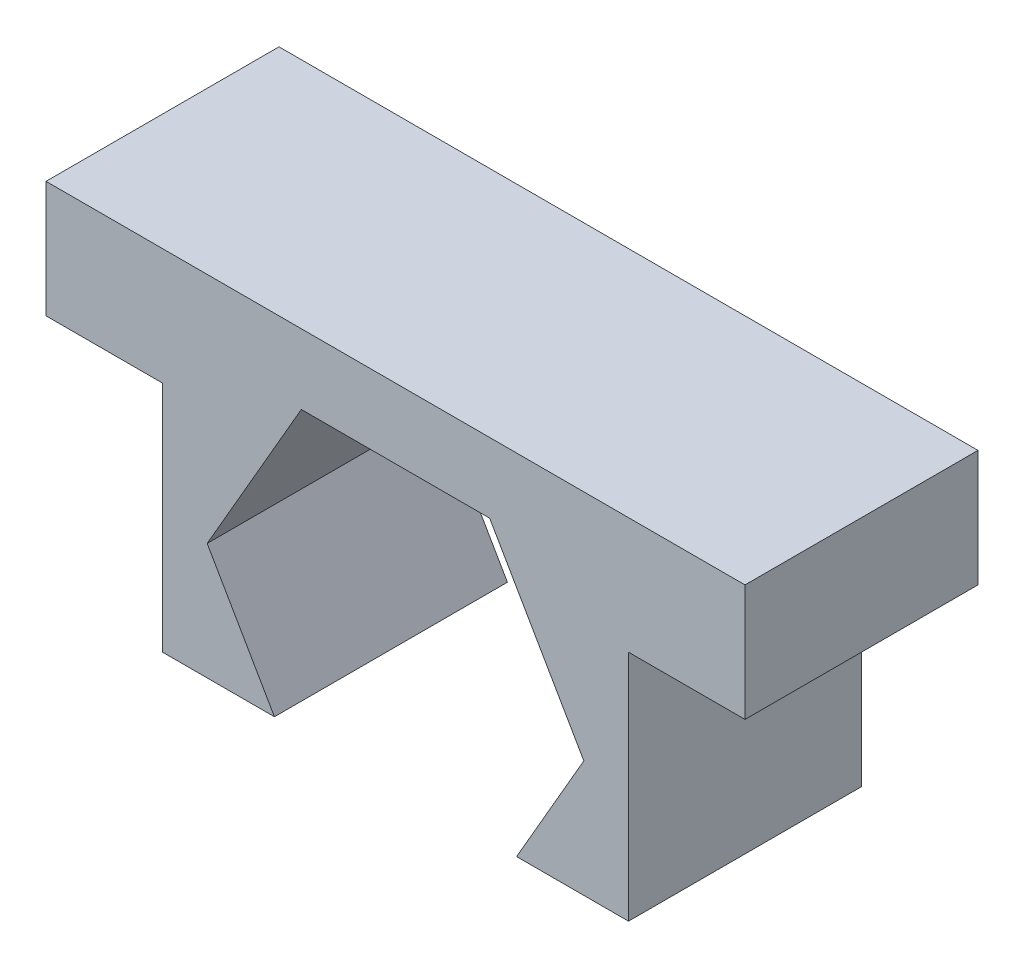
ISO-10303-21;
HEADER;
FILE_DESCRIPTION(('STEP AP214'),'2;1');
FILE_NAME('part.step','',(''),(''),'','','');
FILE_SCHEMA(('AUTOMOTIVE_DESIGN { 1 0 10303 214 1 1 1 1 }'));
ENDSEC;
DATA;
#1=APPLICATION_CONTEXT('core data for automotive mechanical design processes');
#2=APPLICATION_PROTOCOL_DEFINITION('international standard','automotive_design',2000,#1);
#3=PRODUCT_CONTEXT('',#1,'mechanical');
#4=PRODUCT('Part','Part','',(#3));
#5=PRODUCT_RELATED_PRODUCT_CATEGORY('part','',(#4));
#6=PRODUCT_DEFINITION_FORMATION('','',#4);
#7=PRODUCT_DEFINITION_CONTEXT('part definition',#1,'design');
#8=PRODUCT_DEFINITION('design','',#6,#7);
#9=PRODUCT_DEFINITION_SHAPE('','',#8);
#10=(LENGTH_UNIT() NAMED_UNIT(*) SI_UNIT(.MILLI.,.METRE.));
#11=(NAMED_UNIT(*) PLANE_ANGLE_UNIT() SI_UNIT($,.RADIAN.));
#12=(NAMED_UNIT(*) SI_UNIT($,.STERADIAN.) SOLID_ANGLE_UNIT());
#13=UNCERTAINTY_MEASURE_WITH_UNIT(LENGTH_MEASURE(1.E-05),#10,'distance_accuracy_value','');
#14=(GEOMETRIC_REPRESENTATION_CONTEXT(3) GLOBAL_UNCERTAINTY_ASSIGNED_CONTEXT((#13)) GLOBAL_UNIT_ASSIGNED_CONTEXT((#10,
#11,#12)) REPRESENTATION_CONTEXT('',''));
#15=CARTESIAN_POINT('',(0.,0.,0.));
#16=DIRECTION('',(0.,0.,1.));
#17=DIRECTION('',(1.,0.,0.));
#18=AXIS2_PLACEMENT_3D('',#15,#16,#17);
#19=CARTESIAN_POINT('',(0.,0.,5.));
#20=DIRECTION('',(-1.,0.,0.));
#21=DIRECTION('',(0.,0.,1.));
#22=AXIS2_PLACEMENT_3D('',#19,#20,#21);
#23=PLANE('',#22);
#24=DIRECTION('',(0.,1.,0.));
#25=VECTOR('',#24,1.);
#26=CARTESIAN_POINT('',(0.,0.,0.));
#27=LINE('',#26,#25);
#28=CARTESIAN_POINT('',(0.,2.5,0.));
#29=VERTEX_POINT('',#28);
#30=CARTESIAN_POINT('',(0.,7.5,0.));
#31=VERTEX_POINT('',#30);
#32=EDGE_CURVE('E169',#29,#31,#27,.T.);
#33=ORIENTED_EDGE('',*,*,#32,.F.);
#34=DIRECTION('',(0.,0.,-1.));
#35=VECTOR('',#34,1.);
#36=CARTESIAN_POINT('',(0.,2.5,5.));
#37=LINE('',#36,#35);
#38=CARTESIAN_POINT('',(0.,2.5,5.));
#39=VERTEX_POINT('',#38);
#40=EDGE_CURVE('E11',#39,#29,#37,.T.);
#41=ORIENTED_EDGE('',*,*,#40,.F.);
#42=DIRECTION('',(0.,1.,0.));
#43=VECTOR('',#42,1.);
#44=CARTESIAN_POINT('',(0.,0.,5.));
#45=LINE('',#44,#43);
#46=CARTESIAN_POINT('',(0.,7.5,5.));
#47=VERTEX_POINT('',#46);
#48=EDGE_CURVE('E204',#39,#47,#45,.T.);
#49=ORIENTED_EDGE('',*,*,#48,.T.);
#50=DIRECTION('',(0.,0.,-1.));
#51=VECTOR('',#50,1.);
#52=CARTESIAN_POINT('',(0.,7.5,5.));
#53=LINE('',#52,#51);
#54=EDGE_CURVE('E54',#47,#31,#53,.T.);
#55=ORIENTED_EDGE('',*,*,#54,.T.);
#56=EDGE_LOOP('',(#33,#41,#49,#55));
#57=FACE_BOUND('',#56,.T.);
#58=ADVANCED_FACE('F38',(#57),#23,.T.);
#59=CARTESIAN_POINT('',(0.,2.5,5.));
#60=DIRECTION('',(0.,1.,0.));
#61=DIRECTION('',(0.,0.,1.));
#62=AXIS2_PLACEMENT_3D('',#59,#60,#61);
#63=PLANE('',#62);
#64=DIRECTION('',(1.,0.,0.));
#65=VECTOR('',#64,1.);
#66=CARTESIAN_POINT('',(0.,2.5,0.));
#67=LINE('',#66,#65);
#68=CARTESIAN_POINT('',(2.40192378864668,2.5,0.));
#69=VERTEX_POINT('',#68);
#70=EDGE_CURVE('E171',#29,#69,#67,.T.);
#71=ORIENTED_EDGE('',*,*,#70,.T.);
#72=DIRECTION('',(0.,0.,-1.));
#73=VECTOR('',#72,1.);
#74=CARTESIAN_POINT('',(2.40192378864668,2.5,5.));
#75=LINE('',#74,#73);
#76=CARTESIAN_POINT('',(2.40192378864668,2.5,5.));
#77=VERTEX_POINT('',#76);
#78=EDGE_CURVE('E46',#77,#69,#75,.T.);
#79=ORIENTED_EDGE('',*,*,#78,.F.);
#80=DIRECTION('',(1.,0.,0.));
#81=VECTOR('',#80,1.);
#82=CARTESIAN_POINT('',(0.,2.5,5.));
#83=LINE('',#82,#81);
#84=EDGE_CURVE('E246',#39,#77,#83,.T.);
#85=ORIENTED_EDGE('',*,*,#84,.F.);
#86=ORIENTED_EDGE('',*,*,#40,.T.);
#87=EDGE_LOOP('',(#71,#79,#85,#86));
#88=FACE_BOUND('',#87,.T.);
#89=ADVANCED_FACE('F234',(#88),#63,.F.);
#90=CARTESIAN_POINT('',(2.88397459621556,1.6650635094611,5.));
#91=DIRECTION('',(0.866025403784439,0.5,0.));
#92=DIRECTION('',(-0.5,0.866025403784439,0.));
#93=AXIS2_PLACEMENT_3D('',#90,#91,#92);
#94=PLANE('',#93);
#95=DIRECTION('',(0.5,-0.866025403784439,0.));
#96=VECTOR('',#95,1.);
#97=CARTESIAN_POINT('',(2.88397459621556,1.6650635094611,0.));
#98=LINE('',#97,#96);
#99=CARTESIAN_POINT('',(0.95854811567262,5.,0.));
#100=VERTEX_POINT('',#99);
#101=EDGE_CURVE('E174',#100,#69,#98,.T.);
#102=ORIENTED_EDGE('',*,*,#101,.F.);
#103=DIRECTION('',(0.,0.,-1.));
#104=VECTOR('',#103,1.);
#105=CARTESIAN_POINT('',(0.95854811567262,5.,5.));
#106=LINE('',#105,#104);
#107=CARTESIAN_POINT('',(0.95854811567262,5.,5.));
#108=VERTEX_POINT('',#107);
#109=EDGE_CURVE('E224',#108,#100,#106,.T.);
#110=ORIENTED_EDGE('',*,*,#109,.F.);
#111=DIRECTION('',(0.5,-0.866025403784439,0.));
#112=VECTOR('',#111,1.);
#113=CARTESIAN_POINT('',(2.88397459621556,1.6650635094611,5.));
#114=LINE('',#113,#112);
#115=EDGE_CURVE('E231',#108,#77,#114,.T.);
#116=ORIENTED_EDGE('',*,*,#115,.T.);
#117=ORIENTED_EDGE('',*,*,#78,.T.);
#118=EDGE_LOOP('',(#102,#110,#116,#117));
#119=FACE_BOUND('',#118,.T.);
#120=ADVANCED_FACE('F229',(#119),#94,.T.);
#121=CARTESIAN_POINT('',(-1.44615242270663,0.834936490538904,5.));
#122=DIRECTION('',(0.866025403784439,-0.5,0.));
#123=DIRECTION('',(0.5,0.866025403784439,0.));
#124=AXIS2_PLACEMENT_3D('',#121,#122,#123);
#125=PLANE('',#124);
#126=DIRECTION('',(-0.5,-0.866025403784439,0.));
#127=VECTOR('',#126,1.);
#128=CARTESIAN_POINT('',(-1.44615242270663,0.834936490538904,0.));
#129=LINE('',#128,#127);
#130=CARTESIAN_POINT('',(2.97927405783631,8.5,0.));
#131=VERTEX_POINT('',#130);
#132=EDGE_CURVE('E178',#131,#100,#129,.T.);
#133=ORIENTED_EDGE('',*,*,#132,.F.);
#134=DIRECTION('',(0.,0.,-1.));
#135=VECTOR('',#134,1.);
#136=CARTESIAN_POINT('',(2.97927405783631,8.5,5.));
#137=LINE('',#136,#135);
#138=CARTESIAN_POINT('',(2.97927405783631,8.5,5.));
#139=VERTEX_POINT('',#138);
#140=EDGE_CURVE('E222',#139,#131,#137,.T.);
#141=ORIENTED_EDGE('',*,*,#140,.F.);
#142=DIRECTION('',(-0.5,-0.866025403784439,0.));
#143=VECTOR('',#142,1.);
#144=CARTESIAN_POINT('',(-1.44615242270663,0.834936490538904,5.));
#145=LINE('',#144,#143);
#146=EDGE_CURVE('E243',#139,#108,#145,.T.);
#147=ORIENTED_EDGE('',*,*,#146,.T.);
#148=ORIENTED_EDGE('',*,*,#109,.T.);
#149=EDGE_LOOP('',(#133,#141,#147,#148));
#150=FACE_BOUND('',#149,.T.);
#151=ADVANCED_FACE('F240',(#150),#125,.T.);
#152=CARTESIAN_POINT('',(0.,8.5,5.));
#153=DIRECTION('',(0.,-1.,0.));
#154=DIRECTION('',(0.,0.,-1.));
#155=AXIS2_PLACEMENT_3D('',#152,#153,#154);
#156=PLANE('',#155);
#157=DIRECTION('',(-1.,0.,0.));
#158=VECTOR('',#157,1.);
#159=CARTESIAN_POINT('',(0.,8.5,0.));
#160=LINE('',#159,#158);
#161=CARTESIAN_POINT('',(7.02072594216369,8.5,0.));
#162=VERTEX_POINT('',#161);
#163=EDGE_CURVE('E181',#162,#131,#160,.T.);
#164=ORIENTED_EDGE('',*,*,#163,.F.);
#165=DIRECTION('',(0.,0.,-1.));
#166=VECTOR('',#165,1.);
#167=CARTESIAN_POINT('',(7.02072594216369,8.5,5.));
#168=LINE('',#167,#166);
#169=CARTESIAN_POINT('',(7.02072594216369,8.5,5.));
#170=VERTEX_POINT('',#169);
#171=EDGE_CURVE('E220',#170,#162,#168,.T.);
#172=ORIENTED_EDGE('',*,*,#171,.F.);
#173=DIRECTION('',(-1.,0.,0.));
#174=VECTOR('',#173,1.);
#175=CARTESIAN_POINT('',(0.,8.5,5.));
#176=LINE('',#175,#174);
#177=EDGE_CURVE('E248',#170,#139,#176,.T.);
#178=ORIENTED_EDGE('',*,*,#177,.T.);
#179=ORIENTED_EDGE('',*,*,#140,.T.);
#180=EDGE_LOOP('',(#164,#172,#178,#179));
#181=FACE_BOUND('',#180,.T.);
#182=ADVANCED_FACE('F314',(#181),#156,.T.);
#183=CARTESIAN_POINT('',(8.94615242270663,5.16506350946109,5.));
#184=DIRECTION('',(-0.866025403784439,-0.5,0.));
#185=DIRECTION('',(0.5,-0.866025403784439,0.));
#186=AXIS2_PLACEMENT_3D('',#183,#184,#185);
#187=PLANE('',#186);
#188=DIRECTION('',(-0.5,0.866025403784439,0.));
#189=VECTOR('',#188,1.);
#190=CARTESIAN_POINT('',(8.94615242270663,5.16506350946109,0.));
#191=LINE('',#190,#189);
#192=CARTESIAN_POINT('',(9.04145188432738,4.99999999999999,0.));
#193=VERTEX_POINT('',#192);
#194=EDGE_CURVE('E184',#193,#162,#191,.T.);
#195=ORIENTED_EDGE('',*,*,#194,.F.);
#196=DIRECTION('',(0.,0.,-1.));
#197=VECTOR('',#196,1.);
#198=CARTESIAN_POINT('',(9.04145188432738,4.99999999999999,5.));
#199=LINE('',#198,#197);
#200=CARTESIAN_POINT('',(9.04145188432738,4.99999999999999,5.));
#201=VERTEX_POINT('',#200);
#202=EDGE_CURVE('E218',#201,#193,#199,.T.);
#203=ORIENTED_EDGE('',*,*,#202,.F.);
#204=DIRECTION('',(-0.5,0.866025403784439,0.));
#205=VECTOR('',#204,1.);
#206=CARTESIAN_POINT('',(8.94615242270663,5.16506350946109,5.));
#207=LINE('',#206,#205);
#208=EDGE_CURVE('E255',#201,#170,#207,.T.);
#209=ORIENTED_EDGE('',*,*,#208,.T.);
#210=ORIENTED_EDGE('',*,*,#171,.T.);
#211=EDGE_LOOP('',(#195,#203,#209,#210));
#212=FACE_BOUND('',#211,.T.);
#213=ADVANCED_FACE('F302',(#212),#187,.T.);
#214=CARTESIAN_POINT('',(4.61602540378444,-2.6650635094611,5.));
#215=DIRECTION('',(-0.866025403784439,0.5,0.));
#216=DIRECTION('',(-0.5,-0.866025403784439,0.));
#217=AXIS2_PLACEMENT_3D('',#214,#215,#216);
#218=PLANE('',#217);
#219=DIRECTION('',(0.5,0.866025403784439,0.));
#220=VECTOR('',#219,1.);
#221=CARTESIAN_POINT('',(4.61602540378444,-2.6650635094611,0.));
#222=LINE('',#221,#220);
#223=CARTESIAN_POINT('',(7.59807621135332,2.5,0.));
#224=VERTEX_POINT('',#223);
#225=EDGE_CURVE('E187',#224,#193,#222,.T.);
#226=ORIENTED_EDGE('',*,*,#225,.F.);
#227=DIRECTION('',(0.,0.,-1.));
#228=VECTOR('',#227,1.);
#229=CARTESIAN_POINT('',(7.59807621135332,2.5,5.));
#230=LINE('',#229,#228);
#231=CARTESIAN_POINT('',(7.59807621135332,2.5,5.));
#232=VERTEX_POINT('',#231);
#233=EDGE_CURVE('E216',#232,#224,#230,.T.);
#234=ORIENTED_EDGE('',*,*,#233,.F.);
#235=DIRECTION('',(0.5,0.866025403784439,0.));
#236=VECTOR('',#235,1.);
#237=CARTESIAN_POINT('',(4.61602540378444,-2.6650635094611,5.));
#238=LINE('',#237,#236);
#239=EDGE_CURVE('E258',#232,#201,#238,.T.);
#240=ORIENTED_EDGE('',*,*,#239,.T.);
#241=ORIENTED_EDGE('',*,*,#202,.T.);
#242=EDGE_LOOP('',(#226,#234,#240,#241));
#243=FACE_BOUND('',#242,.T.);
#244=ADVANCED_FACE('F295',(#243),#218,.T.);
#245=CARTESIAN_POINT('',(10.,2.5,0.));
#246=VERTEX_POINT('',#245);
#247=EDGE_CURVE('E175',#224,#246,#67,.T.);
#248=ORIENTED_EDGE('',*,*,#247,.T.);
#249=DIRECTION('',(0.,0.,-1.));
#250=VECTOR('',#249,1.);
#251=CARTESIAN_POINT('',(10.,2.5,5.));
#252=LINE('',#251,#250);
#253=CARTESIAN_POINT('',(10.,2.5,5.));
#254=VERTEX_POINT('',#253);
#255=EDGE_CURVE('E213',#254,#246,#252,.T.);
#256=ORIENTED_EDGE('',*,*,#255,.F.);
#257=EDGE_CURVE('E251',#232,#254,#83,.T.);
#258=ORIENTED_EDGE('',*,*,#257,.F.);
#259=ORIENTED_EDGE('',*,*,#233,.T.);
#260=EDGE_LOOP('',(#248,#256,#258,#259));
#261=FACE_BOUND('',#260,.T.);
#262=ADVANCED_FACE('F287',(#261),#63,.F.);
#263=CARTESIAN_POINT('',(10.,0.,5.));
#264=DIRECTION('',(-1.,0.,0.));
#265=DIRECTION('',(0.,0.,1.));
#266=AXIS2_PLACEMENT_3D('',#263,#264,#265);
#267=PLANE('',#266);
#268=DIRECTION('',(0.,1.,0.));
#269=VECTOR('',#268,1.);
#270=CARTESIAN_POINT('',(10.,0.,0.));
#271=LINE('',#270,#269);
#272=CARTESIAN_POINT('',(10.,7.5,0.));
#273=VERTEX_POINT('',#272);
#274=EDGE_CURVE('E190',#246,#273,#271,.T.);
#275=ORIENTED_EDGE('',*,*,#274,.T.);
#276=DIRECTION('',(0.,0.,-1.));
#277=VECTOR('',#276,1.);
#278=CARTESIAN_POINT('',(10.,7.5,5.));
#279=LINE('',#278,#277);
#280=CARTESIAN_POINT('',(10.,7.5,5.));
#281=VERTEX_POINT('',#280);
#282=EDGE_CURVE('E210',#281,#273,#279,.T.);
#283=ORIENTED_EDGE('',*,*,#282,.F.);
#284=DIRECTION('',(0.,1.,0.));
#285=VECTOR('',#284,1.);
#286=CARTESIAN_POINT('',(10.,0.,5.));
#287=LINE('',#286,#285);
#288=EDGE_CURVE('E261',#254,#281,#287,.T.);
#289=ORIENTED_EDGE('',*,*,#288,.F.);
#290=ORIENTED_EDGE('',*,*,#255,.T.);
#291=EDGE_LOOP('',(#275,#283,#289,#290));
#292=FACE_BOUND('',#291,.T.);
#293=ADVANCED_FACE('F294',(#292),#267,.F.);
#294=CARTESIAN_POINT('',(0.,7.5,5.));
#295=DIRECTION('',(0.,1.,0.));
#296=DIRECTION('',(0.,0.,1.));
#297=AXIS2_PLACEMENT_3D('',#294,#295,#296);
#298=PLANE('',#297);
#299=DIRECTION('',(1.,0.,0.));
#300=VECTOR('',#299,1.);
#301=CARTESIAN_POINT('',(0.,7.5,0.));
#302=LINE('',#301,#300);
#303=CARTESIAN_POINT('',(12.5,7.5,0.));
#304=VERTEX_POINT('',#303);
#305=EDGE_CURVE('E192',#273,#304,#302,.T.);
#306=ORIENTED_EDGE('',*,*,#305,.T.);
#307=DIRECTION('',(0.,0.,-1.));
#308=VECTOR('',#307,1.);
#309=CARTESIAN_POINT('',(12.5,7.5,5.));
#310=LINE('',#309,#308);
#311=CARTESIAN_POINT('',(12.5,7.5,5.));
#312=VERTEX_POINT('',#311);
#313=EDGE_CURVE('E208',#312,#304,#310,.T.);
#314=ORIENTED_EDGE('',*,*,#313,.F.);
#315=DIRECTION('',(1.,0.,0.));
#316=VECTOR('',#315,1.);
#317=CARTESIAN_POINT('',(0.,7.5,5.));
#318=LINE('',#317,#316);
#319=EDGE_CURVE('E164',#281,#312,#318,.T.);
#320=ORIENTED_EDGE('',*,*,#319,.F.);
#321=ORIENTED_EDGE('',*,*,#282,.T.);
#322=EDGE_LOOP('',(#306,#314,#320,#321));
#323=FACE_BOUND('',#322,.T.);
#324=ADVANCED_FACE('F267',(#323),#298,.F.);
#325=CARTESIAN_POINT('',(12.5,0.,5.));
#326=DIRECTION('',(1.,0.,0.));
#327=DIRECTION('',(0.,0.,-1.));
#328=AXIS2_PLACEMENT_3D('',#325,#326,#327);
#329=PLANE('',#328);
#330=DIRECTION('',(0.,-1.,0.));
#331=VECTOR('',#330,1.);
#332=CARTESIAN_POINT('',(12.5,0.,0.));
#333=LINE('',#332,#331);
#334=CARTESIAN_POINT('',(12.5,10.,0.));
#335=VERTEX_POINT('',#334);
#336=EDGE_CURVE('E195',#335,#304,#333,.T.);
#337=ORIENTED_EDGE('',*,*,#336,.F.);
#338=DIRECTION('',(0.,0.,-1.));
#339=VECTOR('',#338,1.);
#340=CARTESIAN_POINT('',(12.5,10.,5.));
#341=LINE('',#340,#339);
#342=CARTESIAN_POINT('',(12.5,10.,5.));
#343=VERTEX_POINT('',#342);
#344=EDGE_CURVE('E150',#343,#335,#341,.T.);
#345=ORIENTED_EDGE('',*,*,#344,.F.);
#346=DIRECTION('',(0.,-1.,0.));
#347=VECTOR('',#346,1.);
#348=CARTESIAN_POINT('',(12.5,0.,5.));
#349=LINE('',#348,#347);
#350=EDGE_CURVE('E162',#343,#312,#349,.T.);
#351=ORIENTED_EDGE('',*,*,#350,.T.);
#352=ORIENTED_EDGE('',*,*,#313,.T.);
#353=EDGE_LOOP('',(#337,#345,#351,#352));
#354=FACE_BOUND('',#353,.T.);
#355=ADVANCED_FACE('F271',(#354),#329,.T.);
#356=CARTESIAN_POINT('',(0.,10.,5.));
#357=DIRECTION('',(0.,1.,0.));
#358=DIRECTION('',(0.,0.,1.));
#359=AXIS2_PLACEMENT_3D('',#356,#357,#358);
#360=PLANE('',#359);
#361=DIRECTION('',(1.,0.,0.));
#362=VECTOR('',#361,1.);
#363=CARTESIAN_POINT('',(0.,10.,0.));
#364=LINE('',#363,#362);
#365=CARTESIAN_POINT('',(-2.5,10.,0.));
#366=VERTEX_POINT('',#365);
#367=EDGE_CURVE('E147',#366,#335,#364,.T.);
#368=ORIENTED_EDGE('',*,*,#367,.F.);
#369=DIRECTION('',(0.,0.,-1.));
#370=VECTOR('',#369,1.);
#371=CARTESIAN_POINT('',(-2.5,10.,5.));
#372=LINE('',#371,#370);
#373=CARTESIAN_POINT('',(-2.5,10.,5.));
#374=VERTEX_POINT('',#373);
#375=EDGE_CURVE('E141',#374,#366,#372,.T.);
#376=ORIENTED_EDGE('',*,*,#375,.F.);
#377=DIRECTION('',(1.,0.,0.));
#378=VECTOR('',#377,1.);
#379=CARTESIAN_POINT('',(0.,10.,5.));
#380=LINE('',#379,#378);
#381=EDGE_CURVE('E145',#374,#343,#380,.T.);
#382=ORIENTED_EDGE('',*,*,#381,.T.);
#383=ORIENTED_EDGE('',*,*,#344,.T.);
#384=EDGE_LOOP('',(#368,#376,#382,#383));
#385=FACE_BOUND('',#384,.T.);
#386=ADVANCED_FACE('F143',(#385),#360,.T.);
#387=CARTESIAN_POINT('',(-2.5,0.,5.));
#388=DIRECTION('',(1.,0.,0.));
#389=DIRECTION('',(0.,0.,-1.));
#390=AXIS2_PLACEMENT_3D('',#387,#388,#389);
#391=PLANE('',#390);
#392=DIRECTION('',(0.,-1.,0.));
#393=VECTOR('',#392,1.);
#394=CARTESIAN_POINT('',(-2.5,0.,0.));
#395=LINE('',#394,#393);
#396=CARTESIAN_POINT('',(-2.5,7.5,0.));
#397=VERTEX_POINT('',#396);
#398=EDGE_CURVE('E199',#366,#397,#395,.T.);
#399=ORIENTED_EDGE('',*,*,#398,.T.);
#400=DIRECTION('',(0.,0.,-1.));
#401=VECTOR('',#400,1.);
#402=CARTESIAN_POINT('',(-2.5,7.5,5.));
#403=LINE('',#402,#401);
#404=CARTESIAN_POINT('',(-2.5,7.5,5.));
#405=VERTEX_POINT('',#404);
#406=EDGE_CURVE('E98',#405,#397,#403,.T.);
#407=ORIENTED_EDGE('',*,*,#406,.F.);
#408=DIRECTION('',(0.,-1.,0.));
#409=VECTOR('',#408,1.);
#410=CARTESIAN_POINT('',(-2.5,0.,5.));
#411=LINE('',#410,#409);
#412=EDGE_CURVE('E152',#374,#405,#411,.T.);
#413=ORIENTED_EDGE('',*,*,#412,.F.);
#414=ORIENTED_EDGE('',*,*,#375,.T.);
#415=EDGE_LOOP('',(#399,#407,#413,#414));
#416=FACE_BOUND('',#415,.T.);
#417=ADVANCED_FACE('F153',(#416),#391,.F.);
#418=CARTESIAN_POINT('',(0.,7.5,5.));
#419=DIRECTION('',(0.,-1.,0.));
#420=DIRECTION('',(0.,0.,-1.));
#421=AXIS2_PLACEMENT_3D('',#418,#419,#420);
#422=PLANE('',#421);
#423=DIRECTION('',(-1.,0.,0.));
#424=VECTOR('',#423,1.);
#425=CARTESIAN_POINT('',(0.,7.5,0.));
#426=LINE('',#425,#424);
#427=EDGE_CURVE('E201',#31,#397,#426,.T.);
#428=ORIENTED_EDGE('',*,*,#427,.F.);
#429=ORIENTED_EDGE('',*,*,#54,.F.);
#430=DIRECTION('',(-1.,0.,0.));
#431=VECTOR('',#430,1.);
#432=CARTESIAN_POINT('',(0.,7.5,5.));
#433=LINE('',#432,#431);
#434=EDGE_CURVE('E156',#47,#405,#433,.T.);
#435=ORIENTED_EDGE('',*,*,#434,.T.);
#436=ORIENTED_EDGE('',*,*,#406,.T.);
#437=EDGE_LOOP('',(#428,#429,#435,#436));
#438=FACE_BOUND('',#437,.T.);
#439=ADVANCED_FACE('F272',(#438),#422,.T.);
#440=CARTESIAN_POINT('',(0.,0.,5.));
#441=DIRECTION('',(0.,0.,1.));
#442=DIRECTION('',(1.,0.,0.));
#443=AXIS2_PLACEMENT_3D('',#440,#441,#442);
#444=PLANE('',#443);
#445=ORIENTED_EDGE('',*,*,#48,.F.);
#446=ORIENTED_EDGE('',*,*,#84,.T.);
#447=ORIENTED_EDGE('',*,*,#115,.F.);
#448=ORIENTED_EDGE('',*,*,#146,.F.);
#449=ORIENTED_EDGE('',*,*,#177,.F.);
#450=ORIENTED_EDGE('',*,*,#208,.F.);
#451=ORIENTED_EDGE('',*,*,#239,.F.);
#452=ORIENTED_EDGE('',*,*,#257,.T.);
#453=ORIENTED_EDGE('',*,*,#288,.T.);
#454=ORIENTED_EDGE('',*,*,#319,.T.);
#455=ORIENTED_EDGE('',*,*,#350,.F.);
#456=ORIENTED_EDGE('',*,*,#381,.F.);
#457=ORIENTED_EDGE('',*,*,#412,.T.);
#458=ORIENTED_EDGE('',*,*,#434,.F.);
#459=EDGE_LOOP('',(#445,#446,#447,#448,#449,#450,#451,#452,#453,#454,#455,#456,#457,#458));
#460=FACE_BOUND('',#459,.T.);
#461=ADVANCED_FACE('F160',(#460),#444,.T.);
#462=CARTESIAN_POINT('',(0.,0.,0.));
#463=DIRECTION('',(0.,0.,1.));
#464=DIRECTION('',(1.,0.,0.));
#465=AXIS2_PLACEMENT_3D('',#462,#463,#464);
#466=PLANE('',#465);
#467=ORIENTED_EDGE('',*,*,#32,.T.);
#468=ORIENTED_EDGE('',*,*,#427,.T.);
#469=ORIENTED_EDGE('',*,*,#398,.F.);
#470=ORIENTED_EDGE('',*,*,#367,.T.);
#471=ORIENTED_EDGE('',*,*,#336,.T.);
#472=ORIENTED_EDGE('',*,*,#305,.F.);
#473=ORIENTED_EDGE('',*,*,#274,.F.);
#474=ORIENTED_EDGE('',*,*,#247,.F.);
#475=ORIENTED_EDGE('',*,*,#225,.T.);
#476=ORIENTED_EDGE('',*,*,#194,.T.);
#477=ORIENTED_EDGE('',*,*,#163,.T.);
#478=ORIENTED_EDGE('',*,*,#132,.T.);
#479=ORIENTED_EDGE('',*,*,#101,.T.);
#480=ORIENTED_EDGE('',*,*,#70,.F.);
#481=EDGE_LOOP('',(#467,#468,#469,#470,#471,#472,#473,#474,#475,#476,#477,#478,#479,#480));
#482=FACE_BOUND('',#481,.T.);
#483=ADVANCED_FACE('F236',(#482),#466,.F.);
#484=CLOSED_SHELL('',(#58,#89,#120,#151,#182,#213,#244,#262,#293,#324,#355,#386,#417,#439,#461,#483));
#485=MANIFOLD_SOLID_BREP('B2',#484);
#486=ADVANCED_BREP_SHAPE_REPRESENTATION('',(#18,#485),#14);
#487=SHAPE_DEFINITION_REPRESENTATION(#9,#486);
ENDSEC;
END-ISO-10303-21;
